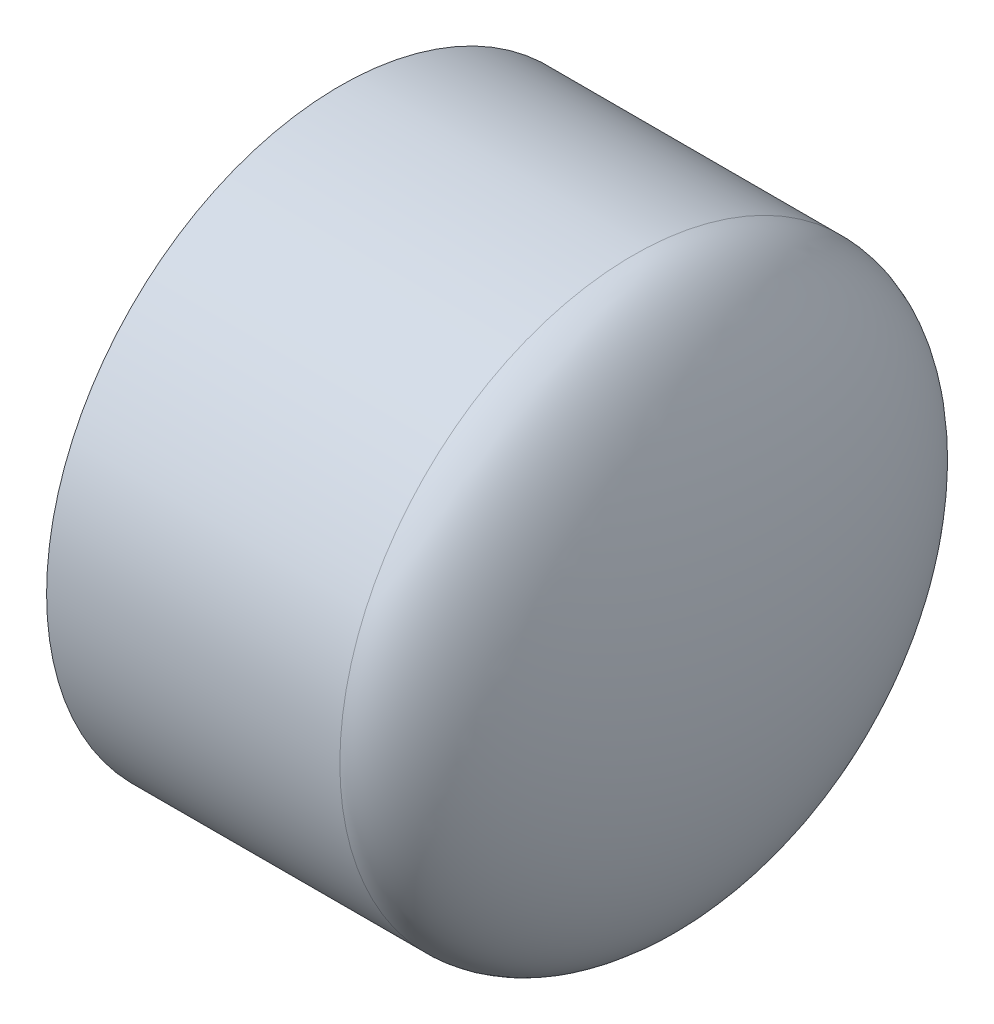
ISO-10303-21;
HEADER;
FILE_DESCRIPTION(('STEP AP214'),'2;1');
FILE_NAME('part.step','',(''),(''),'','','');
FILE_SCHEMA(('AUTOMOTIVE_DESIGN { 1 0 10303 214 1 1 1 1 }'));
ENDSEC;
DATA;
#1=APPLICATION_CONTEXT('core data for automotive mechanical design processes');
#2=APPLICATION_PROTOCOL_DEFINITION('international standard','automotive_design',2000,#1);
#3=PRODUCT_CONTEXT('',#1,'mechanical');
#4=PRODUCT('Part','Part','',(#3));
#5=PRODUCT_RELATED_PRODUCT_CATEGORY('part','',(#4));
#6=PRODUCT_DEFINITION_FORMATION('','',#4);
#7=PRODUCT_DEFINITION_CONTEXT('part definition',#1,'design');
#8=PRODUCT_DEFINITION('design','',#6,#7);
#9=PRODUCT_DEFINITION_SHAPE('','',#8);
#10=(LENGTH_UNIT() NAMED_UNIT(*) SI_UNIT(.MILLI.,.METRE.));
#11=(NAMED_UNIT(*) PLANE_ANGLE_UNIT() SI_UNIT($,.RADIAN.));
#12=(NAMED_UNIT(*) SI_UNIT($,.STERADIAN.) SOLID_ANGLE_UNIT());
#13=UNCERTAINTY_MEASURE_WITH_UNIT(LENGTH_MEASURE(1.E-05),#10,'distance_accuracy_value','');
#14=(GEOMETRIC_REPRESENTATION_CONTEXT(3) GLOBAL_UNCERTAINTY_ASSIGNED_CONTEXT((#13)) GLOBAL_UNIT_ASSIGNED_CONTEXT((#10,
#11,#12)) REPRESENTATION_CONTEXT('',''));
#15=CARTESIAN_POINT('',(0.,0.,0.));
#16=DIRECTION('',(0.,0.,1.));
#17=DIRECTION('',(1.,0.,0.));
#18=AXIS2_PLACEMENT_3D('',#15,#16,#17);
#19=CARTESIAN_POINT('',(-14.732,0.,0.));
#20=DIRECTION('',(0.,0.,1.));
#21=DIRECTION('',(0.,1.,0.));
#22=AXIS2_PLACEMENT_3D('',#19,#20,#21);
#23=ELLIPSE('',#22,38.1,14.732);
#24=TRIMMED_CURVE('',#23,(PARAMETER_VALUE(1.5707963267949)),(PARAMETER_VALUE(4.71238898038469)),
.T.,.PARAMETER.);
#25=CARTESIAN_POINT('',(-52.832,0.,0.));
#26=DIRECTION('',(-1.,0.,0.));
#27=AXIS1_PLACEMENT('',#25,#26);
#28=SURFACE_OF_REVOLUTION('',#24,#27);
#29=CARTESIAN_POINT('',(0.,0.,0.));
#30=VERTEX_POINT('',#29);
#31=VERTEX_LOOP('',#30);
#32=FACE_BOUND('',#31,.T.);
#33=CARTESIAN_POINT('',(-14.732,0.,0.));
#34=DIRECTION('',(-1.,0.,0.));
#35=DIRECTION('',(0.,0.,1.));
#36=AXIS2_PLACEMENT_3D('',#33,#34,#35);
#37=CIRCLE('',#36,38.1);
#38=CARTESIAN_POINT('',(-14.732,0.,38.1));
#39=VERTEX_POINT('',#38);
#40=EDGE_CURVE('E56',#39,#39,#37,.T.);
#41=ORIENTED_EDGE('',*,*,#40,.F.);
#42=EDGE_LOOP('',(#41));
#43=FACE_BOUND('',#42,.T.);
#44=ADVANCED_FACE('F37',(#32,#43),#28,.F.);
#45=CARTESIAN_POINT('',(-14.732,0.,0.));
#46=DIRECTION('',(0.,0.,-1.));
#47=DIRECTION('',(0.,-1.,0.));
#48=AXIS2_PLACEMENT_3D('',#45,#46,#47);
#49=ELLIPSE('',#48,30.0863,6.71829999999999);
#50=TRIMMED_CURVE('',#49,(PARAMETER_VALUE(4.71238898038469)),
(PARAMETER_VALUE(7.85398163397448)),.T.,.PARAMETER.);
#51=CARTESIAN_POINT('',(-52.832,0.,0.));
#52=DIRECTION('',(-1.,0.,0.));
#53=AXIS1_PLACEMENT('',#51,#52);
#54=SURFACE_OF_REVOLUTION('',#50,#53);
#55=CARTESIAN_POINT('',(-14.732,0.,0.));
#56=DIRECTION('',(-1.,0.,0.));
#57=DIRECTION('',(0.,0.,1.));
#58=AXIS2_PLACEMENT_3D('',#55,#56,#57);
#59=CIRCLE('',#58,30.0863);
#60=CARTESIAN_POINT('',(-14.732,0.,30.0863));
#61=VERTEX_POINT('',#60);
#62=EDGE_CURVE('E11',#61,#61,#59,.T.);
#63=ORIENTED_EDGE('',*,*,#62,.T.);
#64=EDGE_LOOP('',(#63));
#65=FACE_BOUND('',#64,.T.);
#66=CARTESIAN_POINT('',(-8.0137,0.,0.));
#67=VERTEX_POINT('',#66);
#68=VERTEX_LOOP('',#67);
#69=FACE_BOUND('',#68,.T.);
#70=ADVANCED_FACE('F53',(#65,#69),#54,.F.);
#71=CARTESIAN_POINT('',(-14.732,0.,0.));
#72=DIRECTION('',(-1.,0.,0.));
#73=DIRECTION('',(0.,0.,1.));
#74=AXIS2_PLACEMENT_3D('',#71,#72,#73);
#75=CONICAL_SURFACE('',#74,30.0863,0.00599992800155504);
#76=CARTESIAN_POINT('',(-52.832,0.,0.));
#77=DIRECTION('',(-1.,0.,0.));
#78=DIRECTION('',(0.,0.,1.));
#79=AXIS2_PLACEMENT_3D('',#76,#77,#78);
#80=CIRCLE('',#79,30.3149);
#81=CARTESIAN_POINT('',(-52.832,0.,30.3149));
#82=VERTEX_POINT('',#81);
#83=EDGE_CURVE('E45',#82,#82,#80,.T.);
#84=ORIENTED_EDGE('',*,*,#83,.T.);
#85=EDGE_LOOP('',(#84));
#86=FACE_BOUND('',#85,.T.);
#87=ORIENTED_EDGE('',*,*,#62,.F.);
#88=EDGE_LOOP('',(#87));
#89=FACE_BOUND('',#88,.T.);
#90=ADVANCED_FACE('F67',(#86,#89),#75,.F.);
#91=CARTESIAN_POINT('',(-52.832,-38.1,0.));
#92=DIRECTION('',(-1.,0.,0.));
#93=DIRECTION('',(0.,0.,1.));
#94=AXIS2_PLACEMENT_3D('',#91,#92,#93);
#95=PLANE('',#94);
#96=CARTESIAN_POINT('',(-52.832,0.,0.));
#97=DIRECTION('',(-1.,0.,0.));
#98=DIRECTION('',(0.,0.,1.));
#99=AXIS2_PLACEMENT_3D('',#96,#97,#98);
#100=CIRCLE('',#99,38.1);
#101=CARTESIAN_POINT('',(-52.832,0.,38.1));
#102=VERTEX_POINT('',#101);
#103=EDGE_CURVE('E58',#102,#102,#100,.T.);
#104=ORIENTED_EDGE('',*,*,#103,.T.);
#105=EDGE_LOOP('',(#104));
#106=FACE_BOUND('',#105,.T.);
#107=ORIENTED_EDGE('',*,*,#83,.F.);
#108=EDGE_LOOP('',(#107));
#109=FACE_BOUND('',#108,.T.);
#110=ADVANCED_FACE('F70',(#106,#109),#95,.T.);
#111=CARTESIAN_POINT('',(-52.832,0.,0.));
#112=DIRECTION('',(-1.,0.,0.));
#113=DIRECTION('',(0.,0.,1.));
#114=AXIS2_PLACEMENT_3D('',#111,#112,#113);
#115=CYLINDRICAL_SURFACE('',#114,38.1);
#116=ORIENTED_EDGE('',*,*,#40,.T.);
#117=EDGE_LOOP('',(#116));
#118=FACE_BOUND('',#117,.T.);
#119=ORIENTED_EDGE('',*,*,#103,.F.);
#120=EDGE_LOOP('',(#119));
#121=FACE_BOUND('',#120,.T.);
#122=ADVANCED_FACE('F72',(#118,#121),#115,.T.);
#123=CLOSED_SHELL('',(#44,#70,#90,#110,#122));
#124=MANIFOLD_SOLID_BREP('B2',#123);
#125=ADVANCED_BREP_SHAPE_REPRESENTATION('',(#18,#124),#14);
#126=SHAPE_DEFINITION_REPRESENTATION(#9,#125);
ENDSEC;
END-ISO-10303-21;
